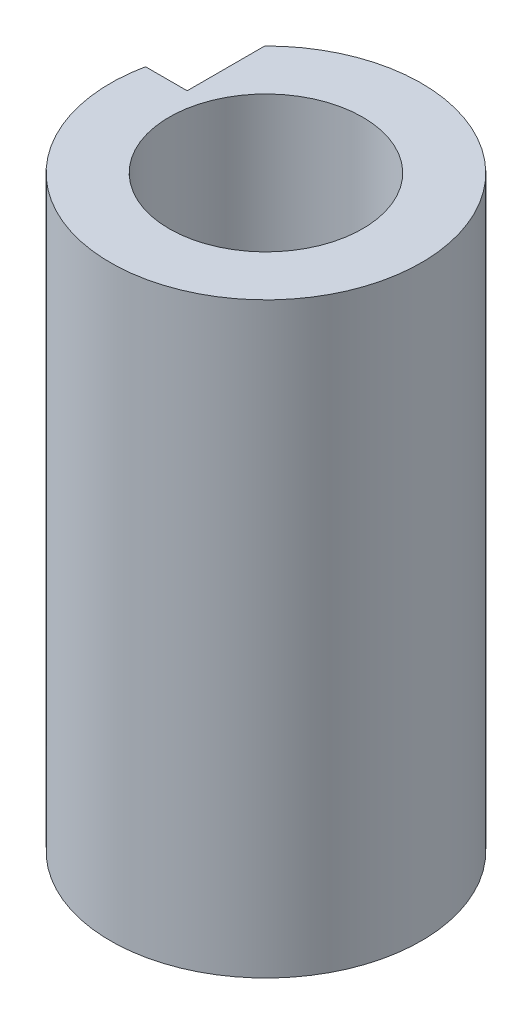
ISO-10303-21;
HEADER;
FILE_DESCRIPTION(('STEP AP214'),'2;1');
FILE_NAME('part.step','',(''),(''),'','','');
FILE_SCHEMA(('AUTOMOTIVE_DESIGN { 1 0 10303 214 1 1 1 1 }'));
ENDSEC;
DATA;
#1=APPLICATION_CONTEXT('core data for automotive mechanical design processes');
#2=APPLICATION_PROTOCOL_DEFINITION('international standard','automotive_design',2000,#1);
#3=PRODUCT_CONTEXT('',#1,'mechanical');
#4=PRODUCT('Part','Part','',(#3));
#5=PRODUCT_RELATED_PRODUCT_CATEGORY('part','',(#4));
#6=PRODUCT_DEFINITION_FORMATION('','',#4);
#7=PRODUCT_DEFINITION_CONTEXT('part definition',#1,'design');
#8=PRODUCT_DEFINITION('design','',#6,#7);
#9=PRODUCT_DEFINITION_SHAPE('','',#8);
#10=(LENGTH_UNIT() NAMED_UNIT(*) SI_UNIT(.MILLI.,.METRE.));
#11=(NAMED_UNIT(*) PLANE_ANGLE_UNIT() SI_UNIT($,.RADIAN.));
#12=(NAMED_UNIT(*) SI_UNIT($,.STERADIAN.) SOLID_ANGLE_UNIT());
#13=UNCERTAINTY_MEASURE_WITH_UNIT(LENGTH_MEASURE(1.E-05),#10,'distance_accuracy_value','');
#14=(GEOMETRIC_REPRESENTATION_CONTEXT(3) GLOBAL_UNCERTAINTY_ASSIGNED_CONTEXT((#13)) GLOBAL_UNIT_ASSIGNED_CONTEXT((#10,
#11,#12)) REPRESENTATION_CONTEXT('',''));
#15=CARTESIAN_POINT('',(0.,0.,0.));
#16=DIRECTION('',(0.,0.,1.));
#17=DIRECTION('',(1.,0.,0.));
#18=AXIS2_PLACEMENT_3D('',#15,#16,#17);
#19=CARTESIAN_POINT('',(0.,13.6499570107158,-11.1909088742892));
#20=DIRECTION('',(0.,0.,1.));
#21=DIRECTION('',(1.,0.,0.));
#22=AXIS2_PLACEMENT_3D('',#19,#20,#21);
#23=PLANE('',#22);
#24=DIRECTION('',(-1.,0.,0.));
#25=VECTOR('',#24,1.);
#26=CARTESIAN_POINT('',(0.,4.78599598003686,-11.1909088742892));
#27=LINE('',#26,#25);
#28=CARTESIAN_POINT('',(-118.499243173625,4.78599598003686,-11.1909088742892));
#29=VERTEX_POINT('',#28);
#30=CARTESIAN_POINT('',(-119.101719053176,4.78599598003686,-11.1909088742892));
#31=VERTEX_POINT('',#30);
#32=EDGE_CURVE('E50',#29,#31,#27,.T.);
#33=ORIENTED_EDGE('',*,*,#32,.F.);
#34=DIRECTION('',(0.,-1.,0.));
#35=VECTOR('',#34,1.);
#36=CARTESIAN_POINT('',(-118.499243173625,13.6499570107158,-11.1909088742892));
#37=LINE('',#36,#35);
#38=CARTESIAN_POINT('',(-118.499243173625,-3.71400401996314,-11.1909088742892));
#39=VERTEX_POINT('',#38);
#40=EDGE_CURVE('E45',#29,#39,#37,.T.);
#41=ORIENTED_EDGE('',*,*,#40,.T.);
#42=DIRECTION('',(-1.,0.,0.));
#43=VECTOR('',#42,1.);
#44=CARTESIAN_POINT('',(0.,-3.71400401996314,-11.1909088742892));
#45=LINE('',#44,#43);
#46=CARTESIAN_POINT('',(-119.101719053176,-3.71400401996314,-11.1909088742892));
#47=VERTEX_POINT('',#46);
#48=EDGE_CURVE('E80',#39,#47,#45,.T.);
#49=ORIENTED_EDGE('',*,*,#48,.T.);
#50=DIRECTION('',(0.,-1.,0.));
#51=VECTOR('',#50,1.);
#52=CARTESIAN_POINT('',(-119.101719053176,13.6499570107158,-11.1909088742892));
#53=LINE('',#52,#51);
#54=EDGE_CURVE('E75',#31,#47,#53,.T.);
#55=ORIENTED_EDGE('',*,*,#54,.F.);
#56=EDGE_LOOP('',(#33,#41,#49,#55));
#57=FACE_BOUND('',#56,.T.);
#58=ADVANCED_FACE('F41',(#57),#23,.F.);
#59=CARTESIAN_POINT('',(-116.899243173625,13.6499570107158,-10.7309088742892));
#60=DIRECTION('',(0.,-1.,0.));
#61=DIRECTION('',(0.,0.,-1.));
#62=AXIS2_PLACEMENT_3D('',#59,#60,#61);
#63=CYLINDRICAL_SURFACE('',#62,2.25);
#64=CARTESIAN_POINT('',(-116.899243173625,4.78599598003686,-10.7309088742892));
#65=DIRECTION('',(0.,1.,0.));
#66=DIRECTION('',(0.,0.,1.));
#67=AXIS2_PLACEMENT_3D('',#64,#65,#66);
#68=CIRCLE('',#67,2.25);
#69=CARTESIAN_POINT('',(-118.499243173625,4.78599598003686,-12.3128380762448));
#70=VERTEX_POINT('',#69);
#71=EDGE_CURVE('E11',#31,#70,#68,.T.);
#72=ORIENTED_EDGE('',*,*,#71,.F.);
#73=ORIENTED_EDGE('',*,*,#54,.T.);
#74=CARTESIAN_POINT('',(-116.899243173625,-3.71400401996314,-10.7309088742892));
#75=DIRECTION('',(0.,1.,0.));
#76=DIRECTION('',(0.,0.,1.));
#77=AXIS2_PLACEMENT_3D('',#74,#75,#76);
#78=CIRCLE('',#77,2.25);
#79=CARTESIAN_POINT('',(-118.499243173625,-3.71400401996314,-12.3128380762448));
#80=VERTEX_POINT('',#79);
#81=EDGE_CURVE('E90',#47,#80,#78,.T.);
#82=ORIENTED_EDGE('',*,*,#81,.T.);
#83=DIRECTION('',(0.,-1.,0.));
#84=VECTOR('',#83,1.);
#85=CARTESIAN_POINT('',(-118.499243173625,13.6499570107158,-12.3128380762448));
#86=LINE('',#85,#84);
#87=EDGE_CURVE('E63',#70,#80,#86,.T.);
#88=ORIENTED_EDGE('',*,*,#87,.F.);
#89=EDGE_LOOP('',(#72,#73,#82,#88));
#90=FACE_BOUND('',#89,.T.);
#91=ADVANCED_FACE('F112',(#90),#63,.T.);
#92=CARTESIAN_POINT('',(-116.899243173625,13.6499570107158,-10.7309088742892));
#93=DIRECTION('',(0.,-1.,0.));
#94=DIRECTION('',(0.,0.,-1.));
#95=AXIS2_PLACEMENT_3D('',#92,#93,#94);
#96=CYLINDRICAL_SURFACE('',#95,1.4);
#97=CARTESIAN_POINT('',(-116.899243173625,-3.71400401996314,-10.7309088742892));
#98=DIRECTION('',(0.,1.,0.));
#99=DIRECTION('',(0.,0.,1.));
#100=AXIS2_PLACEMENT_3D('',#97,#98,#99);
#101=CIRCLE('',#100,1.4);
#102=CARTESIAN_POINT('',(-116.899243173625,-3.71400401996314,-9.33090887428917));
#103=VERTEX_POINT('',#102);
#104=EDGE_CURVE('E87',#103,#103,#101,.T.);
#105=ORIENTED_EDGE('',*,*,#104,.F.);
#106=EDGE_LOOP('',(#105));
#107=FACE_BOUND('',#106,.T.);
#108=CARTESIAN_POINT('',(-116.899243173625,4.78599598003686,-10.7309088742892));
#109=DIRECTION('',(0.,1.,0.));
#110=DIRECTION('',(0.,0.,1.));
#111=AXIS2_PLACEMENT_3D('',#108,#109,#110);
#112=CIRCLE('',#111,1.4);
#113=CARTESIAN_POINT('',(-116.899243173625,4.78599598003686,-9.33090887428917));
#114=VERTEX_POINT('',#113);
#115=EDGE_CURVE('E98',#114,#114,#112,.T.);
#116=ORIENTED_EDGE('',*,*,#115,.T.);
#117=EDGE_LOOP('',(#116));
#118=FACE_BOUND('',#117,.T.);
#119=ADVANCED_FACE('F116',(#107,#118),#96,.F.);
#120=CARTESIAN_POINT('',(-118.499243173625,13.6499570107158,0.));
#121=DIRECTION('',(1.,0.,0.));
#122=DIRECTION('',(0.,0.,-1.));
#123=AXIS2_PLACEMENT_3D('',#120,#121,#122);
#124=PLANE('',#123);
#125=DIRECTION('',(0.,0.,1.));
#126=VECTOR('',#125,1.);
#127=CARTESIAN_POINT('',(-118.499243173625,4.78599598003686,0.));
#128=LINE('',#127,#126);
#129=EDGE_CURVE('E97',#70,#29,#128,.T.);
#130=ORIENTED_EDGE('',*,*,#129,.F.);
#131=ORIENTED_EDGE('',*,*,#87,.T.);
#132=DIRECTION('',(0.,0.,1.));
#133=VECTOR('',#132,1.);
#134=CARTESIAN_POINT('',(-118.499243173625,-3.71400401996314,0.));
#135=LINE('',#134,#133);
#136=EDGE_CURVE('E84',#80,#39,#135,.T.);
#137=ORIENTED_EDGE('',*,*,#136,.T.);
#138=ORIENTED_EDGE('',*,*,#40,.F.);
#139=EDGE_LOOP('',(#130,#131,#137,#138));
#140=FACE_BOUND('',#139,.T.);
#141=ADVANCED_FACE('F85',(#140),#124,.F.);
#142=CARTESIAN_POINT('',(0.,-3.71400401996314,0.));
#143=DIRECTION('',(0.,1.,0.));
#144=DIRECTION('',(0.,0.,1.));
#145=AXIS2_PLACEMENT_3D('',#142,#143,#144);
#146=PLANE('',#145);
#147=ORIENTED_EDGE('',*,*,#104,.T.);
#148=EDGE_LOOP('',(#147));
#149=FACE_BOUND('',#148,.T.);
#150=ORIENTED_EDGE('',*,*,#48,.F.);
#151=ORIENTED_EDGE('',*,*,#136,.F.);
#152=ORIENTED_EDGE('',*,*,#81,.F.);
#153=EDGE_LOOP('',(#150,#151,#152));
#154=FACE_BOUND('',#153,.T.);
#155=ADVANCED_FACE('F89',(#149,#154),#146,.F.);
#156=CARTESIAN_POINT('',(-129.899243173625,4.78599598003686,-11.5909088742892));
#157=DIRECTION('',(0.,1.,0.));
#158=DIRECTION('',(0.,0.,1.));
#159=AXIS2_PLACEMENT_3D('',#156,#157,#158);
#160=PLANE('',#159);
#161=ORIENTED_EDGE('',*,*,#115,.F.);
#162=EDGE_LOOP('',(#161));
#163=FACE_BOUND('',#162,.T.);
#164=ORIENTED_EDGE('',*,*,#129,.T.);
#165=ORIENTED_EDGE('',*,*,#32,.T.);
#166=ORIENTED_EDGE('',*,*,#71,.T.);
#167=EDGE_LOOP('',(#164,#165,#166));
#168=FACE_BOUND('',#167,.T.);
#169=ADVANCED_FACE('F43',(#163,#168),#160,.T.);
#170=CLOSED_SHELL('',(#58,#91,#119,#141,#155,#169));
#171=MANIFOLD_SOLID_BREP('B2',#170);
#172=ADVANCED_BREP_SHAPE_REPRESENTATION('',(#18,#171),#14);
#173=SHAPE_DEFINITION_REPRESENTATION(#9,#172);
ENDSEC;
END-ISO-10303-21;
